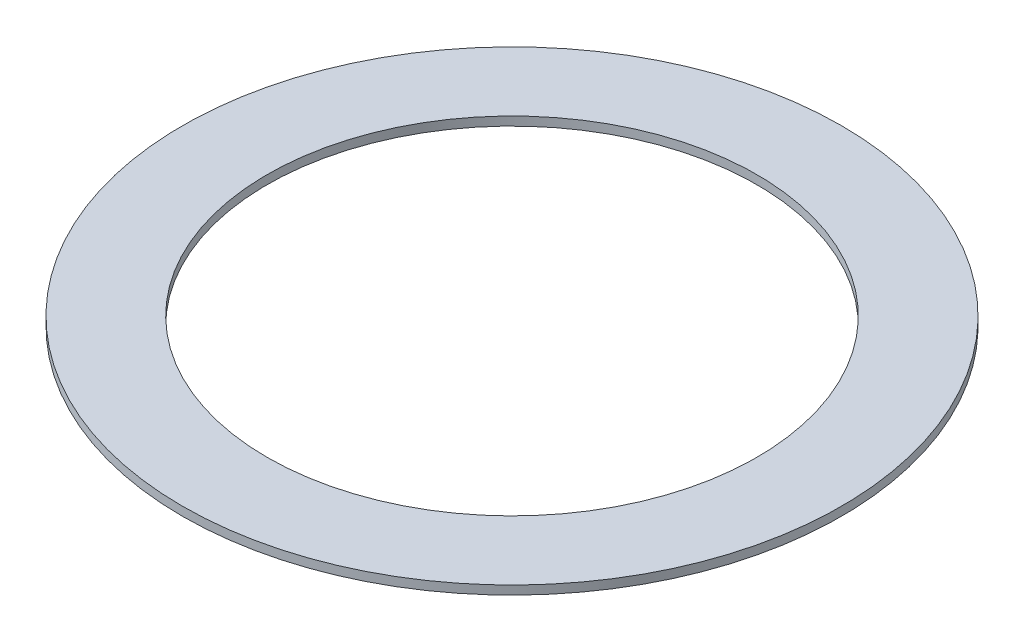
ISO-10303-21;
HEADER;
FILE_DESCRIPTION(('STEP AP214'),'2;1');
FILE_NAME('part.step','',(''),(''),'','','');
FILE_SCHEMA(('AUTOMOTIVE_DESIGN { 1 0 10303 214 1 1 1 1 }'));
ENDSEC;
DATA;
#1=APPLICATION_CONTEXT('core data for automotive mechanical design processes');
#2=APPLICATION_PROTOCOL_DEFINITION('international standard','automotive_design',2000,#1);
#3=PRODUCT_CONTEXT('',#1,'mechanical');
#4=PRODUCT('Part','Part','',(#3));
#5=PRODUCT_RELATED_PRODUCT_CATEGORY('part','',(#4));
#6=PRODUCT_DEFINITION_FORMATION('','',#4);
#7=PRODUCT_DEFINITION_CONTEXT('part definition',#1,'design');
#8=PRODUCT_DEFINITION('design','',#6,#7);
#9=PRODUCT_DEFINITION_SHAPE('','',#8);
#10=(LENGTH_UNIT() NAMED_UNIT(*) SI_UNIT(.MILLI.,.METRE.));
#11=(NAMED_UNIT(*) PLANE_ANGLE_UNIT() SI_UNIT($,.RADIAN.));
#12=(NAMED_UNIT(*) SI_UNIT($,.STERADIAN.) SOLID_ANGLE_UNIT());
#13=UNCERTAINTY_MEASURE_WITH_UNIT(LENGTH_MEASURE(1.E-05),#10,'distance_accuracy_value','');
#14=(GEOMETRIC_REPRESENTATION_CONTEXT(3) GLOBAL_UNCERTAINTY_ASSIGNED_CONTEXT((#13)) GLOBAL_UNIT_ASSIGNED_CONTEXT((#10,
#11,#12)) REPRESENTATION_CONTEXT('',''));
#15=CARTESIAN_POINT('',(0.,0.,0.));
#16=DIRECTION('',(0.,0.,1.));
#17=DIRECTION('',(1.,0.,0.));
#18=AXIS2_PLACEMENT_3D('',#15,#16,#17);
#19=CARTESIAN_POINT('',(0.,3.175,0.));
#20=DIRECTION('',(0.,1.,0.));
#21=DIRECTION('',(0.,0.,1.));
#22=AXIS2_PLACEMENT_3D('',#19,#20,#21);
#23=PLANE('',#22);
#24=CARTESIAN_POINT('',(0.,3.175,0.));
#25=DIRECTION('',(0.,1.,0.));
#26=DIRECTION('',(0.,0.,1.));
#27=AXIS2_PLACEMENT_3D('',#24,#25,#26);
#28=CIRCLE('',#27,119.634);
#29=CARTESIAN_POINT('',(0.,3.175,119.634));
#30=VERTEX_POINT('',#29);
#31=EDGE_CURVE('E10',#30,#30,#28,.T.);
#32=ORIENTED_EDGE('',*,*,#31,.T.);
#33=EDGE_LOOP('',(#32));
#34=FACE_BOUND('',#33,.T.);
#35=CARTESIAN_POINT('',(0.,3.175,0.));
#36=DIRECTION('',(0.,1.,0.));
#37=DIRECTION('',(0.,0.,1.));
#38=AXIS2_PLACEMENT_3D('',#35,#36,#37);
#39=CIRCLE('',#38,88.9);
#40=CARTESIAN_POINT('',(0.,3.175,88.9));
#41=VERTEX_POINT('',#40);
#42=EDGE_CURVE('E50',#41,#41,#39,.T.);
#43=ORIENTED_EDGE('',*,*,#42,.F.);
#44=EDGE_LOOP('',(#43));
#45=FACE_BOUND('',#44,.T.);
#46=ADVANCED_FACE('F37',(#34,#45),#23,.T.);
#47=CARTESIAN_POINT('',(0.,0.,0.));
#48=DIRECTION('',(0.,1.,0.));
#49=DIRECTION('',(0.,0.,1.));
#50=AXIS2_PLACEMENT_3D('',#47,#48,#49);
#51=PLANE('',#50);
#52=CARTESIAN_POINT('',(0.,0.,0.));
#53=DIRECTION('',(0.,1.,0.));
#54=DIRECTION('',(0.,0.,1.));
#55=AXIS2_PLACEMENT_3D('',#52,#53,#54);
#56=CIRCLE('',#55,119.634);
#57=CARTESIAN_POINT('',(0.,0.,119.634));
#58=VERTEX_POINT('',#57);
#59=EDGE_CURVE('E41',#58,#58,#56,.T.);
#60=ORIENTED_EDGE('',*,*,#59,.F.);
#61=EDGE_LOOP('',(#60));
#62=FACE_BOUND('',#61,.T.);
#63=CARTESIAN_POINT('',(0.,0.,0.));
#64=DIRECTION('',(0.,1.,0.));
#65=DIRECTION('',(0.,0.,1.));
#66=AXIS2_PLACEMENT_3D('',#63,#64,#65);
#67=CIRCLE('',#66,88.9);
#68=CARTESIAN_POINT('',(0.,0.,88.9));
#69=VERTEX_POINT('',#68);
#70=EDGE_CURVE('E52',#69,#69,#67,.T.);
#71=ORIENTED_EDGE('',*,*,#70,.T.);
#72=EDGE_LOOP('',(#71));
#73=FACE_BOUND('',#72,.T.);
#74=ADVANCED_FACE('F64',(#62,#73),#51,.F.);
#75=CARTESIAN_POINT('',(0.,3.175,0.));
#76=DIRECTION('',(0.,-1.,0.));
#77=DIRECTION('',(0.,0.,-1.));
#78=AXIS2_PLACEMENT_3D('',#75,#76,#77);
#79=CYLINDRICAL_SURFACE('',#78,119.634);
#80=ORIENTED_EDGE('',*,*,#31,.F.);
#81=EDGE_LOOP('',(#80));
#82=FACE_BOUND('',#81,.T.);
#83=ORIENTED_EDGE('',*,*,#59,.T.);
#84=EDGE_LOOP('',(#83));
#85=FACE_BOUND('',#84,.T.);
#86=ADVANCED_FACE('F39',(#82,#85),#79,.T.);
#87=CARTESIAN_POINT('',(0.,3.175,0.));
#88=DIRECTION('',(0.,-1.,0.));
#89=DIRECTION('',(0.,0.,-1.));
#90=AXIS2_PLACEMENT_3D('',#87,#88,#89);
#91=CYLINDRICAL_SURFACE('',#90,88.9);
#92=ORIENTED_EDGE('',*,*,#42,.T.);
#93=EDGE_LOOP('',(#92));
#94=FACE_BOUND('',#93,.T.);
#95=ORIENTED_EDGE('',*,*,#70,.F.);
#96=EDGE_LOOP('',(#95));
#97=FACE_BOUND('',#96,.T.);
#98=ADVANCED_FACE('F60',(#94,#97),#91,.F.);
#99=CLOSED_SHELL('',(#46,#74,#86,#98));
#100=MANIFOLD_SOLID_BREP('B2',#99);
#101=ADVANCED_BREP_SHAPE_REPRESENTATION('',(#18,#100),#14);
#102=SHAPE_DEFINITION_REPRESENTATION(#9,#101);
ENDSEC;
END-ISO-10303-21;
